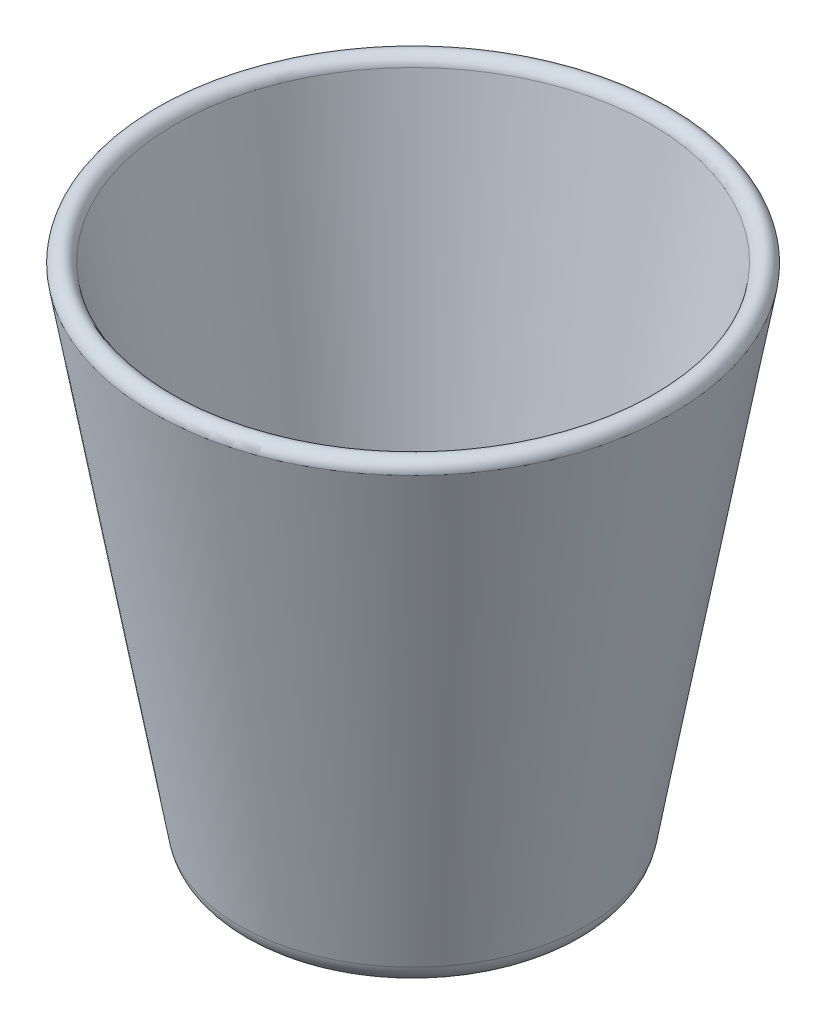
ISO-10303-21;
HEADER;
FILE_DESCRIPTION(('STEP AP214'),'2;1');
FILE_NAME('part.step','',(''),(''),'','','');
FILE_SCHEMA(('AUTOMOTIVE_DESIGN { 1 0 10303 214 1 1 1 1 }'));
ENDSEC;
DATA;
#1=APPLICATION_CONTEXT('core data for automotive mechanical design processes');
#2=APPLICATION_PROTOCOL_DEFINITION('international standard','automotive_design',2000,#1);
#3=PRODUCT_CONTEXT('',#1,'mechanical');
#4=PRODUCT('Part','Part','',(#3));
#5=PRODUCT_RELATED_PRODUCT_CATEGORY('part','',(#4));
#6=PRODUCT_DEFINITION_FORMATION('','',#4);
#7=PRODUCT_DEFINITION_CONTEXT('part definition',#1,'design');
#8=PRODUCT_DEFINITION('design','',#6,#7);
#9=PRODUCT_DEFINITION_SHAPE('','',#8);
#10=(LENGTH_UNIT() NAMED_UNIT(*) SI_UNIT(.MILLI.,.METRE.));
#11=(NAMED_UNIT(*) PLANE_ANGLE_UNIT() SI_UNIT($,.RADIAN.));
#12=(NAMED_UNIT(*) SI_UNIT($,.STERADIAN.) SOLID_ANGLE_UNIT());
#13=UNCERTAINTY_MEASURE_WITH_UNIT(LENGTH_MEASURE(1.E-05),#10,'distance_accuracy_value','');
#14=(GEOMETRIC_REPRESENTATION_CONTEXT(3) GLOBAL_UNCERTAINTY_ASSIGNED_CONTEXT((#13)) GLOBAL_UNIT_ASSIGNED_CONTEXT((#10,
#11,#12)) REPRESENTATION_CONTEXT('',''));
#15=CARTESIAN_POINT('',(0.,0.,0.));
#16=DIRECTION('',(0.,0.,1.));
#17=DIRECTION('',(1.,0.,0.));
#18=AXIS2_PLACEMENT_3D('',#15,#16,#17);
#19=CARTESIAN_POINT('',(0.,0.,0.));
#20=DIRECTION('',(0.,-1.,0.));
#21=DIRECTION('',(0.,0.,-1.));
#22=AXIS2_PLACEMENT_3D('',#19,#20,#21);
#23=PLANE('',#22);
#24=CARTESIAN_POINT('',(0.,0.,0.));
#25=DIRECTION('',(0.,-1.,0.));
#26=DIRECTION('',(0.,0.,-1.));
#27=AXIS2_PLACEMENT_3D('',#24,#25,#26);
#28=CIRCLE('',#27,66.2094700162955);
#29=CARTESIAN_POINT('',(0.,0.,-66.2094700162955));
#30=VERTEX_POINT('',#29);
#31=EDGE_CURVE('E10',#30,#30,#28,.T.);
#32=ORIENTED_EDGE('',*,*,#31,.T.);
#33=EDGE_LOOP('',(#32));
#34=FACE_BOUND('',#33,.T.);
#35=ADVANCED_FACE('F31',(#34),#23,.T.);
#36=CARTESIAN_POINT('',(0.,11.90625,0.));
#37=DIRECTION('',(0.,-1.,0.));
#38=DIRECTION('',(0.,0.,-1.));
#39=AXIS2_PLACEMENT_3D('',#36,#37,#38);
#40=TOROIDAL_SURFACE('',#39,66.2094700162955,11.90625);
#41=CARTESIAN_POINT('',(0.,9.8387513846531,0.));
#42=DIRECTION('',(0.,-1.,0.));
#43=DIRECTION('',(0.,0.,-1.));
#44=AXIS2_PLACEMENT_3D('',#41,#42,#43);
#45=CIRCLE('',#44,77.9348373255971);
#46=CARTESIAN_POINT('',(0.,9.8387513846531,-77.9348373255971));
#47=VERTEX_POINT('',#46);
#48=EDGE_CURVE('E37',#47,#47,#45,.T.);
#49=ORIENTED_EDGE('',*,*,#48,.T.);
#50=EDGE_LOOP('',(#49));
#51=FACE_BOUND('',#50,.T.);
#52=ORIENTED_EDGE('',*,*,#31,.F.);
#53=EDGE_LOOP('',(#52));
#54=FACE_BOUND('',#53,.T.);
#55=ADVANCED_FACE('F69',(#51,#54),#40,.T.);
#56=CARTESIAN_POINT('',(0.,9.8387513846531,0.));
#57=DIRECTION('',(0.,1.,0.));
#58=DIRECTION('',(0.,0.,1.));
#59=AXIS2_PLACEMENT_3D('',#56,#57,#58);
#60=CONICAL_SURFACE('',#59,77.9348373255971,0.174532925199433);
#61=CARTESIAN_POINT('',(0.,228.6,0.));
#62=DIRECTION('',(0.,-1.,0.));
#63=DIRECTION('',(0.,0.,-1.));
#64=AXIS2_PLACEMENT_3D('',#61,#62,#63);
#65=CIRCLE('',#64,116.508347789955);
#66=CARTESIAN_POINT('',(0.,228.6,-116.508347789955));
#67=VERTEX_POINT('',#66);
#68=EDGE_CURVE('E41',#67,#67,#65,.T.);
#69=ORIENTED_EDGE('',*,*,#68,.T.);
#70=EDGE_LOOP('',(#69));
#71=FACE_BOUND('',#70,.T.);
#72=ORIENTED_EDGE('',*,*,#48,.F.);
#73=EDGE_LOOP('',(#72));
#74=FACE_BOUND('',#73,.T.);
#75=ADVANCED_FACE('F73',(#71,#74),#60,.T.);
#76=CARTESIAN_POINT('',(0.,228.6,0.));
#77=DIRECTION('',(0.,-1.,0.));
#78=DIRECTION('',(0.,0.,-1.));
#79=AXIS2_PLACEMENT_3D('',#76,#77,#78);
#80=TOROIDAL_SURFACE('',#79,111.709394346961,4.79895344299444);
#81=CARTESIAN_POINT('',(0.,229.433329520084,0.));
#82=DIRECTION('',(0.,-1.,0.));
#83=DIRECTION('',(0.,0.,-1.));
#84=AXIS2_PLACEMENT_3D('',#81,#82,#83);
#85=CIRCLE('',#84,106.983347789955);
#86=CARTESIAN_POINT('',(0.,229.433329520084,-106.983347789955));
#87=VERTEX_POINT('',#86);
#88=EDGE_CURVE('E45',#87,#87,#85,.T.);
#89=ORIENTED_EDGE('',*,*,#88,.T.);
#90=EDGE_LOOP('',(#89));
#91=FACE_BOUND('',#90,.T.);
#92=ORIENTED_EDGE('',*,*,#68,.F.);
#93=EDGE_LOOP('',(#92));
#94=FACE_BOUND('',#93,.T.);
#95=ADVANCED_FACE('F77',(#91,#94),#80,.T.);
#96=CARTESIAN_POINT('',(0.,229.433329520084,0.));
#97=DIRECTION('',(0.,1.,0.));
#98=DIRECTION('',(0.,0.,1.));
#99=AXIS2_PLACEMENT_3D('',#96,#97,#98);
#100=CONICAL_SURFACE('',#99,106.983347789955,0.174532925199433);
#101=CARTESIAN_POINT('',(0.,11.4927502769306,0.));
#102=DIRECTION('',(0.,-1.,0.));
#103=DIRECTION('',(0.,0.,-1.));
#104=AXIS2_PLACEMENT_3D('',#101,#102,#103);
#105=CIRCLE('',#104,68.5545434781559);
#106=CARTESIAN_POINT('',(0.,11.4927502769306,-68.5545434781559));
#107=VERTEX_POINT('',#106);
#108=EDGE_CURVE('E50',#107,#107,#105,.T.);
#109=ORIENTED_EDGE('',*,*,#108,.T.);
#110=EDGE_LOOP('',(#109));
#111=FACE_BOUND('',#110,.T.);
#112=ORIENTED_EDGE('',*,*,#88,.F.);
#113=EDGE_LOOP('',(#112));
#114=FACE_BOUND('',#113,.T.);
#115=ADVANCED_FACE('F66',(#111,#114),#100,.F.);
#116=CARTESIAN_POINT('',(0.,11.90625,0.));
#117=DIRECTION('',(0.,-1.,0.));
#118=DIRECTION('',(0.,0.,-1.));
#119=AXIS2_PLACEMENT_3D('',#116,#117,#118);
#120=TOROIDAL_SURFACE('',#119,66.2094700162955,2.38125);
#121=CARTESIAN_POINT('',(0.,9.525,0.));
#122=DIRECTION('',(0.,-1.,0.));
#123=DIRECTION('',(0.,0.,-1.));
#124=AXIS2_PLACEMENT_3D('',#121,#122,#123);
#125=CIRCLE('',#124,66.2094700162955);
#126=CARTESIAN_POINT('',(0.,9.525,-66.2094700162955));
#127=VERTEX_POINT('',#126);
#128=EDGE_CURVE('E53',#127,#127,#125,.T.);
#129=ORIENTED_EDGE('',*,*,#128,.T.);
#130=EDGE_LOOP('',(#129));
#131=FACE_BOUND('',#130,.T.);
#132=ORIENTED_EDGE('',*,*,#108,.F.);
#133=EDGE_LOOP('',(#132));
#134=FACE_BOUND('',#133,.T.);
#135=ADVANCED_FACE('F57',(#131,#134),#120,.F.);
#136=CARTESIAN_POINT('',(0.,9.525,0.));
#137=DIRECTION('',(0.,1.,0.));
#138=DIRECTION('',(0.,0.,1.));
#139=AXIS2_PLACEMENT_3D('',#136,#137,#138);
#140=PLANE('',#139);
#141=ORIENTED_EDGE('',*,*,#128,.F.);
#142=EDGE_LOOP('',(#141));
#143=FACE_BOUND('',#142,.T.);
#144=ADVANCED_FACE('F60',(#143),#140,.T.);
#145=CLOSED_SHELL('',(#35,#55,#75,#95,#115,#135,#144));
#146=MANIFOLD_SOLID_BREP('B2',#145);
#147=ADVANCED_BREP_SHAPE_REPRESENTATION('',(#18,#146),#14);
#148=SHAPE_DEFINITION_REPRESENTATION(#9,#147);
ENDSEC;
END-ISO-10303-21;
